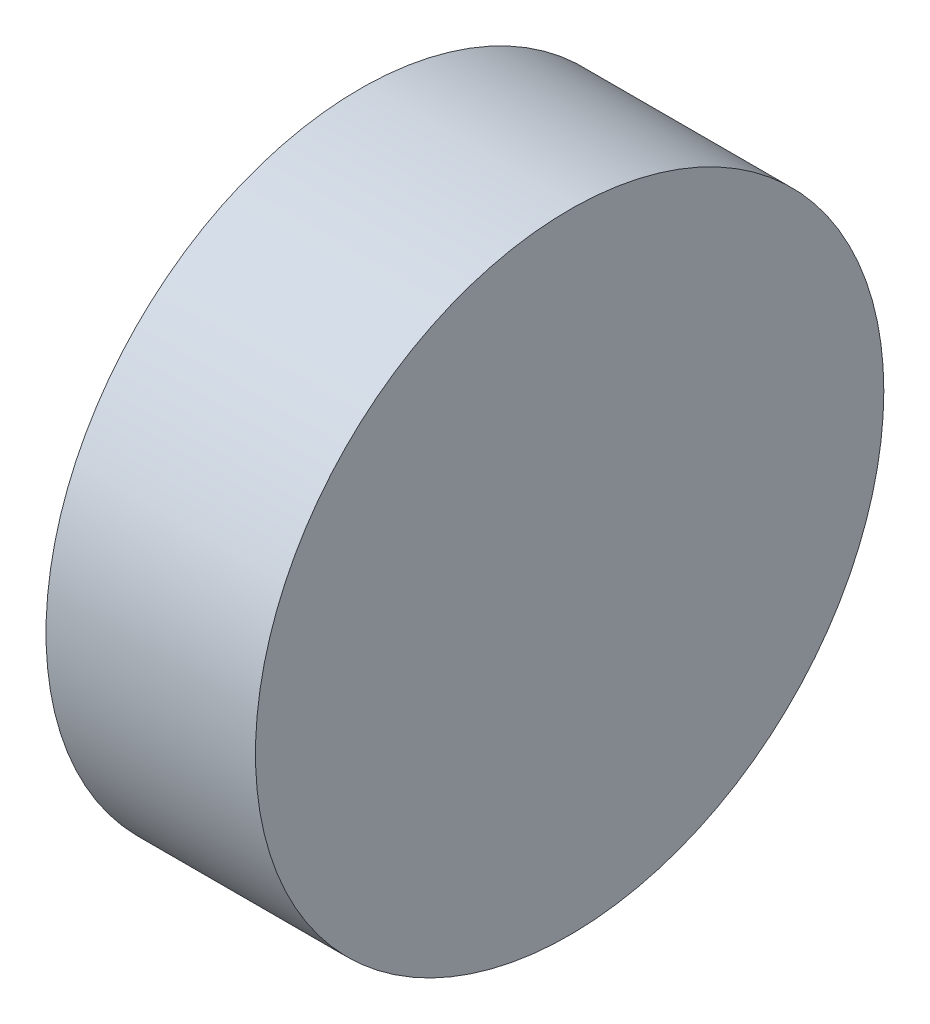
ISO-10303-21;
HEADER;
FILE_DESCRIPTION(('STEP AP214'),'2;1');
FILE_NAME('part.step','',(''),(''),'','','');
FILE_SCHEMA(('AUTOMOTIVE_DESIGN { 1 0 10303 214 1 1 1 1 }'));
ENDSEC;
DATA;
#1=APPLICATION_CONTEXT('core data for automotive mechanical design processes');
#2=APPLICATION_PROTOCOL_DEFINITION('international standard','automotive_design',2000,#1);
#3=PRODUCT_CONTEXT('',#1,'mechanical');
#4=PRODUCT('Part','Part','',(#3));
#5=PRODUCT_RELATED_PRODUCT_CATEGORY('part','',(#4));
#6=PRODUCT_DEFINITION_FORMATION('','',#4);
#7=PRODUCT_DEFINITION_CONTEXT('part definition',#1,'design');
#8=PRODUCT_DEFINITION('design','',#6,#7);
#9=PRODUCT_DEFINITION_SHAPE('','',#8);
#10=(LENGTH_UNIT() NAMED_UNIT(*) SI_UNIT(.MILLI.,.METRE.));
#11=(NAMED_UNIT(*) PLANE_ANGLE_UNIT() SI_UNIT($,.RADIAN.));
#12=(NAMED_UNIT(*) SI_UNIT($,.STERADIAN.) SOLID_ANGLE_UNIT());
#13=UNCERTAINTY_MEASURE_WITH_UNIT(LENGTH_MEASURE(1.E-05),#10,'distance_accuracy_value','');
#14=(GEOMETRIC_REPRESENTATION_CONTEXT(3) GLOBAL_UNCERTAINTY_ASSIGNED_CONTEXT((#13)) GLOBAL_UNIT_ASSIGNED_CONTEXT((#10,
#11,#12)) REPRESENTATION_CONTEXT('',''));
#15=CARTESIAN_POINT('',(0.,0.,0.));
#16=DIRECTION('',(0.,0.,1.));
#17=DIRECTION('',(1.,0.,0.));
#18=AXIS2_PLACEMENT_3D('',#15,#16,#17);
#19=CARTESIAN_POINT('',(50.8,0.,0.));
#20=DIRECTION('',(-1.,0.,0.));
#21=DIRECTION('',(0.,0.,1.));
#22=AXIS2_PLACEMENT_3D('',#19,#20,#21);
#23=CYLINDRICAL_SURFACE('',#22,76.2);
#24=CARTESIAN_POINT('',(50.8,0.,0.));
#25=DIRECTION('',(1.,0.,0.));
#26=DIRECTION('',(0.,0.,-1.));
#27=AXIS2_PLACEMENT_3D('',#24,#25,#26);
#28=CIRCLE('',#27,76.2);
#29=CARTESIAN_POINT('',(50.8,0.,-76.2));
#30=VERTEX_POINT('',#29);
#31=EDGE_CURVE('E10',#30,#30,#28,.T.);
#32=ORIENTED_EDGE('',*,*,#31,.F.);
#33=EDGE_LOOP('',(#32));
#34=FACE_BOUND('',#33,.T.);
#35=CARTESIAN_POINT('',(0.,0.,0.));
#36=DIRECTION('',(1.,0.,0.));
#37=DIRECTION('',(0.,0.,-1.));
#38=AXIS2_PLACEMENT_3D('',#35,#36,#37);
#39=CIRCLE('',#38,76.2);
#40=CARTESIAN_POINT('',(0.,0.,-76.2));
#41=VERTEX_POINT('',#40);
#42=EDGE_CURVE('E34',#41,#41,#39,.T.);
#43=ORIENTED_EDGE('',*,*,#42,.T.);
#44=EDGE_LOOP('',(#43));
#45=FACE_BOUND('',#44,.T.);
#46=ADVANCED_FACE('F31',(#34,#45),#23,.T.);
#47=CARTESIAN_POINT('',(50.8,0.,0.));
#48=DIRECTION('',(1.,0.,0.));
#49=DIRECTION('',(0.,0.,-1.));
#50=AXIS2_PLACEMENT_3D('',#47,#48,#49);
#51=PLANE('',#50);
#52=ORIENTED_EDGE('',*,*,#31,.T.);
#53=EDGE_LOOP('',(#52));
#54=FACE_BOUND('',#53,.T.);
#55=ADVANCED_FACE('F46',(#54),#51,.T.);
#56=CARTESIAN_POINT('',(0.,0.,0.));
#57=DIRECTION('',(1.,0.,0.));
#58=DIRECTION('',(0.,0.,-1.));
#59=AXIS2_PLACEMENT_3D('',#56,#57,#58);
#60=PLANE('',#59);
#61=ORIENTED_EDGE('',*,*,#42,.F.);
#62=EDGE_LOOP('',(#61));
#63=FACE_BOUND('',#62,.T.);
#64=ADVANCED_FACE('F44',(#63),#60,.F.);
#65=CLOSED_SHELL('',(#46,#55,#64));
#66=MANIFOLD_SOLID_BREP('B2',#65);
#67=ADVANCED_BREP_SHAPE_REPRESENTATION('',(#18,#66),#14);
#68=SHAPE_DEFINITION_REPRESENTATION(#9,#67);
ENDSEC;
END-ISO-10303-21;
